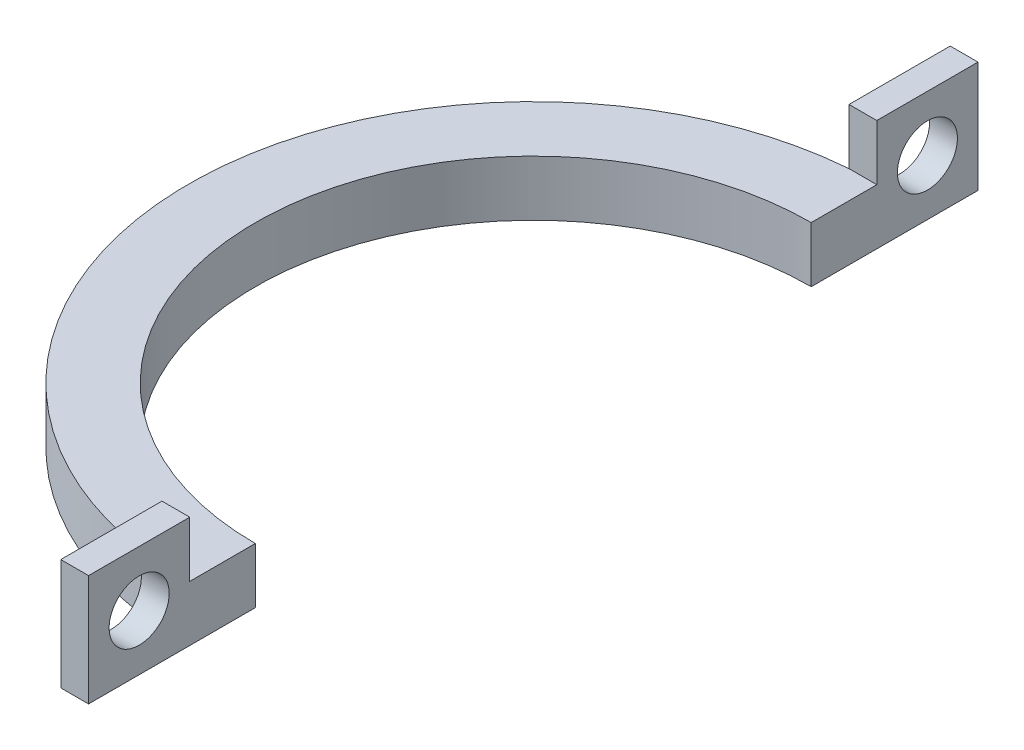
ISO-10303-21;
HEADER;
FILE_DESCRIPTION(('STEP AP214'),'2;1');
FILE_NAME('part.step','',(''),(''),'','','');
FILE_SCHEMA(('AUTOMOTIVE_DESIGN { 1 0 10303 214 1 1 1 1 }'));
ENDSEC;
DATA;
#1=APPLICATION_CONTEXT('core data for automotive mechanical design processes');
#2=APPLICATION_PROTOCOL_DEFINITION('international standard','automotive_design',2000,#1);
#3=PRODUCT_CONTEXT('',#1,'mechanical');
#4=PRODUCT('Part','Part','',(#3));
#5=PRODUCT_RELATED_PRODUCT_CATEGORY('part','',(#4));
#6=PRODUCT_DEFINITION_FORMATION('','',#4);
#7=PRODUCT_DEFINITION_CONTEXT('part definition',#1,'design');
#8=PRODUCT_DEFINITION('design','',#6,#7);
#9=PRODUCT_DEFINITION_SHAPE('','',#8);
#10=(LENGTH_UNIT() NAMED_UNIT(*) SI_UNIT(.MILLI.,.METRE.));
#11=(NAMED_UNIT(*) PLANE_ANGLE_UNIT() SI_UNIT($,.RADIAN.));
#12=(NAMED_UNIT(*) SI_UNIT($,.STERADIAN.) SOLID_ANGLE_UNIT());
#13=UNCERTAINTY_MEASURE_WITH_UNIT(LENGTH_MEASURE(1.E-05),#10,'distance_accuracy_value','');
#14=(GEOMETRIC_REPRESENTATION_CONTEXT(3) GLOBAL_UNCERTAINTY_ASSIGNED_CONTEXT((#13)) GLOBAL_UNIT_ASSIGNED_CONTEXT((#10,
#11,#12)) REPRESENTATION_CONTEXT('',''));
#15=CARTESIAN_POINT('',(0.,0.,0.));
#16=DIRECTION('',(0.,0.,1.));
#17=DIRECTION('',(1.,0.,0.));
#18=AXIS2_PLACEMENT_3D('',#15,#16,#17);
#19=CARTESIAN_POINT('',(0.,5.,0.));
#20=DIRECTION('',(0.,1.,0.));
#21=DIRECTION('',(0.,0.,1.));
#22=AXIS2_PLACEMENT_3D('',#19,#20,#21);
#23=PLANE('',#22);
#24=CARTESIAN_POINT('',(0.,5.,0.));
#25=DIRECTION('',(0.,1.,0.));
#26=DIRECTION('',(0.,0.,1.));
#27=AXIS2_PLACEMENT_3D('',#24,#25,#26);
#28=CIRCLE('',#27,31.);
#29=CARTESIAN_POINT('',(-2.5,5.,-30.8990291109608));
#30=VERTEX_POINT('',#29);
#31=CARTESIAN_POINT('',(-2.5,5.,30.8990291109608));
#32=VERTEX_POINT('',#31);
#33=EDGE_CURVE('E210',#30,#32,#28,.T.);
#34=ORIENTED_EDGE('',*,*,#33,.T.);
#35=DIRECTION('',(-1.,0.,0.));
#36=VECTOR('',#35,1.);
#37=CARTESIAN_POINT('',(0.,5.,30.8990291109608));
#38=LINE('',#37,#36);
#39=CARTESIAN_POINT('',(0.,5.,30.8990291109608));
#40=VERTEX_POINT('',#39);
#41=EDGE_CURVE('E157',#40,#32,#38,.T.);
#42=ORIENTED_EDGE('',*,*,#41,.F.);
#43=DIRECTION('',(0.,0.,1.));
#44=VECTOR('',#43,1.);
#45=CARTESIAN_POINT('',(0.,5.,0.));
#46=LINE('',#45,#44);
#47=CARTESIAN_POINT('',(0.,5.,25.));
#48=VERTEX_POINT('',#47);
#49=EDGE_CURVE('E214',#48,#40,#46,.T.);
#50=ORIENTED_EDGE('',*,*,#49,.F.);
#51=CARTESIAN_POINT('',(0.,5.,0.));
#52=DIRECTION('',(0.,1.,0.));
#53=DIRECTION('',(0.,0.,1.));
#54=AXIS2_PLACEMENT_3D('',#51,#52,#53);
#55=CIRCLE('',#54,25.);
#56=CARTESIAN_POINT('',(0.,5.,-25.));
#57=VERTEX_POINT('',#56);
#58=EDGE_CURVE('E203',#57,#48,#55,.T.);
#59=ORIENTED_EDGE('',*,*,#58,.F.);
#60=DIRECTION('',(0.,0.,-1.));
#61=VECTOR('',#60,1.);
#62=CARTESIAN_POINT('',(0.,5.,0.));
#63=LINE('',#62,#61);
#64=CARTESIAN_POINT('',(0.,5.,-30.8990291109608));
#65=VERTEX_POINT('',#64);
#66=EDGE_CURVE('E206',#57,#65,#63,.T.);
#67=ORIENTED_EDGE('',*,*,#66,.T.);
#68=DIRECTION('',(1.,0.,0.));
#69=VECTOR('',#68,1.);
#70=CARTESIAN_POINT('',(-2.5,5.,-30.8990291109608));
#71=LINE('',#70,#69);
#72=EDGE_CURVE('E175',#30,#65,#71,.T.);
#73=ORIENTED_EDGE('',*,*,#72,.F.);
#74=EDGE_LOOP('',(#34,#42,#50,#59,#67,#73));
#75=FACE_BOUND('',#74,.T.);
#76=ADVANCED_FACE('F41',(#75),#23,.T.);
#77=CARTESIAN_POINT('',(0.,5.,0.));
#78=DIRECTION('',(0.,-1.,0.));
#79=DIRECTION('',(0.,0.,-1.));
#80=AXIS2_PLACEMENT_3D('',#77,#78,#79);
#81=CYLINDRICAL_SURFACE('',#80,25.);
#82=CARTESIAN_POINT('',(0.,0.,0.));
#83=DIRECTION('',(0.,1.,0.));
#84=DIRECTION('',(0.,0.,1.));
#85=AXIS2_PLACEMENT_3D('',#82,#83,#84);
#86=CIRCLE('',#85,25.);
#87=CARTESIAN_POINT('',(0.,0.,-25.));
#88=VERTEX_POINT('',#87);
#89=CARTESIAN_POINT('',(0.,0.,25.));
#90=VERTEX_POINT('',#89);
#91=EDGE_CURVE('E202',#88,#90,#86,.T.);
#92=ORIENTED_EDGE('',*,*,#91,.F.);
#93=DIRECTION('',(0.,-1.,0.));
#94=VECTOR('',#93,1.);
#95=CARTESIAN_POINT('',(0.,5.,-25.));
#96=LINE('',#95,#94);
#97=EDGE_CURVE('E11',#57,#88,#96,.T.);
#98=ORIENTED_EDGE('',*,*,#97,.F.);
#99=ORIENTED_EDGE('',*,*,#58,.T.);
#100=DIRECTION('',(0.,-1.,0.));
#101=VECTOR('',#100,1.);
#102=CARTESIAN_POINT('',(0.,5.,25.));
#103=LINE('',#102,#101);
#104=EDGE_CURVE('E66',#48,#90,#103,.T.);
#105=ORIENTED_EDGE('',*,*,#104,.T.);
#106=EDGE_LOOP('',(#92,#98,#99,#105));
#107=FACE_BOUND('',#106,.T.);
#108=ADVANCED_FACE('F43',(#107),#81,.F.);
#109=CARTESIAN_POINT('',(0.,5.,0.));
#110=DIRECTION('',(-1.,0.,0.));
#111=DIRECTION('',(0.,0.,1.));
#112=AXIS2_PLACEMENT_3D('',#109,#110,#111);
#113=PLANE('',#112);
#114=CARTESIAN_POINT('',(0.,5.,-35.4495145554804));
#115=DIRECTION('',(-1.,0.,0.));
#116=DIRECTION('',(0.,0.,1.));
#117=AXIS2_PLACEMENT_3D('',#114,#115,#116);
#118=CIRCLE('',#117,2.7);
#119=CARTESIAN_POINT('',(0.,5.,-32.7495145554804));
#120=VERTEX_POINT('',#119);
#121=EDGE_CURVE('E160',#120,#120,#118,.F.);
#122=ORIENTED_EDGE('',*,*,#121,.F.);
#123=EDGE_LOOP('',(#122));
#124=FACE_BOUND('',#123,.T.);
#125=DIRECTION('',(0.,0.,-1.));
#126=VECTOR('',#125,1.);
#127=CARTESIAN_POINT('',(0.,0.,0.));
#128=LINE('',#127,#126);
#129=CARTESIAN_POINT('',(0.,0.,-40.));
#130=VERTEX_POINT('',#129);
#131=EDGE_CURVE('E219',#88,#130,#128,.T.);
#132=ORIENTED_EDGE('',*,*,#131,.T.);
#133=DIRECTION('',(0.,-1.,0.));
#134=VECTOR('',#133,1.);
#135=CARTESIAN_POINT('',(0.,5.,-40.));
#136=LINE('',#135,#134);
#137=CARTESIAN_POINT('',(0.,10.,-40.));
#138=VERTEX_POINT('',#137);
#139=EDGE_CURVE('E50',#138,#130,#136,.T.);
#140=ORIENTED_EDGE('',*,*,#139,.F.);
#141=DIRECTION('',(0.,0.,-1.));
#142=VECTOR('',#141,1.);
#143=CARTESIAN_POINT('',(0.,10.,-30.8990291109608));
#144=LINE('',#143,#142);
#145=CARTESIAN_POINT('',(0.,10.,-30.8990291109608));
#146=VERTEX_POINT('',#145);
#147=EDGE_CURVE('E183',#146,#138,#144,.T.);
#148=ORIENTED_EDGE('',*,*,#147,.F.);
#149=DIRECTION('',(0.,-1.,0.));
#150=VECTOR('',#149,1.);
#151=CARTESIAN_POINT('',(0.,10.,-30.8990291109608));
#152=LINE('',#151,#150);
#153=EDGE_CURVE('E191',#146,#65,#152,.T.);
#154=ORIENTED_EDGE('',*,*,#153,.T.);
#155=ORIENTED_EDGE('',*,*,#66,.F.);
#156=ORIENTED_EDGE('',*,*,#97,.T.);
#157=EDGE_LOOP('',(#132,#140,#148,#154,#155,#156));
#158=FACE_BOUND('',#157,.T.);
#159=ADVANCED_FACE('F281',(#124,#158),#113,.F.);
#160=CARTESIAN_POINT('',(0.,5.,-40.));
#161=DIRECTION('',(0.,0.,1.));
#162=DIRECTION('',(1.,0.,0.));
#163=AXIS2_PLACEMENT_3D('',#160,#161,#162);
#164=PLANE('',#163);
#165=DIRECTION('',(-1.,0.,0.));
#166=VECTOR('',#165,1.);
#167=CARTESIAN_POINT('',(0.,0.,-40.));
#168=LINE('',#167,#166);
#169=CARTESIAN_POINT('',(-2.5,0.,-40.));
#170=VERTEX_POINT('',#169);
#171=EDGE_CURVE('E222',#130,#170,#168,.T.);
#172=ORIENTED_EDGE('',*,*,#171,.T.);
#173=DIRECTION('',(0.,-1.,0.));
#174=VECTOR('',#173,1.);
#175=CARTESIAN_POINT('',(-2.5,5.,-40.));
#176=LINE('',#175,#174);
#177=CARTESIAN_POINT('',(-2.5,10.,-40.));
#178=VERTEX_POINT('',#177);
#179=EDGE_CURVE('E250',#178,#170,#176,.T.);
#180=ORIENTED_EDGE('',*,*,#179,.F.);
#181=DIRECTION('',(-1.,0.,0.));
#182=VECTOR('',#181,1.);
#183=CARTESIAN_POINT('',(0.,10.,-40.));
#184=LINE('',#183,#182);
#185=EDGE_CURVE('E187',#138,#178,#184,.T.);
#186=ORIENTED_EDGE('',*,*,#185,.F.);
#187=ORIENTED_EDGE('',*,*,#139,.T.);
#188=EDGE_LOOP('',(#172,#180,#186,#187));
#189=FACE_BOUND('',#188,.T.);
#190=ADVANCED_FACE('F258',(#189),#164,.F.);
#191=CARTESIAN_POINT('',(-2.5,5.,0.));
#192=DIRECTION('',(1.,0.,0.));
#193=DIRECTION('',(0.,0.,-1.));
#194=AXIS2_PLACEMENT_3D('',#191,#192,#193);
#195=PLANE('',#194);
#196=CARTESIAN_POINT('',(-2.5,5.,-35.4495145554804));
#197=DIRECTION('',(-1.,0.,0.));
#198=DIRECTION('',(0.,0.,1.));
#199=AXIS2_PLACEMENT_3D('',#196,#197,#198);
#200=CIRCLE('',#199,2.7);
#201=CARTESIAN_POINT('',(-2.5,5.,-32.7495145554804));
#202=VERTEX_POINT('',#201);
#203=EDGE_CURVE('E465',#202,#202,#200,.T.);
#204=ORIENTED_EDGE('',*,*,#203,.F.);
#205=EDGE_LOOP('',(#204));
#206=FACE_BOUND('',#205,.T.);
#207=DIRECTION('',(0.,0.,1.));
#208=VECTOR('',#207,1.);
#209=CARTESIAN_POINT('',(-2.5,0.,0.));
#210=LINE('',#209,#208);
#211=CARTESIAN_POINT('',(-2.5,0.,-30.8990291109608));
#212=VERTEX_POINT('',#211);
#213=EDGE_CURVE('E225',#170,#212,#210,.T.);
#214=ORIENTED_EDGE('',*,*,#213,.T.);
#215=DIRECTION('',(0.,-1.,0.));
#216=VECTOR('',#215,1.);
#217=CARTESIAN_POINT('',(-2.5,5.,-30.8990291109608));
#218=LINE('',#217,#216);
#219=EDGE_CURVE('E246',#30,#212,#218,.T.);
#220=ORIENTED_EDGE('',*,*,#219,.F.);
#221=DIRECTION('',(0.,-1.,0.));
#222=VECTOR('',#221,1.);
#223=CARTESIAN_POINT('',(-2.5,10.,-30.8990291109608));
#224=LINE('',#223,#222);
#225=CARTESIAN_POINT('',(-2.5,10.,-30.8990291109608));
#226=VERTEX_POINT('',#225);
#227=EDGE_CURVE('E198',#226,#30,#224,.T.);
#228=ORIENTED_EDGE('',*,*,#227,.F.);
#229=DIRECTION('',(0.,0.,1.));
#230=VECTOR('',#229,1.);
#231=CARTESIAN_POINT('',(-2.5,10.,-40.));
#232=LINE('',#231,#230);
#233=EDGE_CURVE('E176',#178,#226,#232,.T.);
#234=ORIENTED_EDGE('',*,*,#233,.F.);
#235=ORIENTED_EDGE('',*,*,#179,.T.);
#236=EDGE_LOOP('',(#214,#220,#228,#234,#235));
#237=FACE_BOUND('',#236,.T.);
#238=ADVANCED_FACE('F268',(#206,#237),#195,.F.);
#239=CARTESIAN_POINT('',(0.,5.,0.));
#240=DIRECTION('',(0.,-1.,0.));
#241=DIRECTION('',(0.,0.,-1.));
#242=AXIS2_PLACEMENT_3D('',#239,#240,#241);
#243=CYLINDRICAL_SURFACE('',#242,31.);
#244=CARTESIAN_POINT('',(0.,0.,0.));
#245=DIRECTION('',(0.,1.,0.));
#246=DIRECTION('',(0.,0.,1.));
#247=AXIS2_PLACEMENT_3D('',#244,#245,#246);
#248=CIRCLE('',#247,31.);
#249=CARTESIAN_POINT('',(-2.5,0.,30.8990291109608));
#250=VERTEX_POINT('',#249);
#251=EDGE_CURVE('E228',#212,#250,#248,.T.);
#252=ORIENTED_EDGE('',*,*,#251,.T.);
#253=DIRECTION('',(0.,-1.,0.));
#254=VECTOR('',#253,1.);
#255=CARTESIAN_POINT('',(-2.5,5.,30.8990291109608));
#256=LINE('',#255,#254);
#257=EDGE_CURVE('E142',#32,#250,#256,.T.);
#258=ORIENTED_EDGE('',*,*,#257,.F.);
#259=ORIENTED_EDGE('',*,*,#33,.F.);
#260=ORIENTED_EDGE('',*,*,#219,.T.);
#261=EDGE_LOOP('',(#252,#258,#259,#260));
#262=FACE_BOUND('',#261,.T.);
#263=ADVANCED_FACE('F273',(#262),#243,.T.);
#264=CARTESIAN_POINT('',(-2.5,5.,0.));
#265=DIRECTION('',(-1.,0.,0.));
#266=DIRECTION('',(0.,0.,1.));
#267=AXIS2_PLACEMENT_3D('',#264,#265,#266);
#268=PLANE('',#267);
#269=CARTESIAN_POINT('',(-2.5,5.,35.4495145554804));
#270=DIRECTION('',(-1.,0.,0.));
#271=DIRECTION('',(0.,0.,-1.));
#272=AXIS2_PLACEMENT_3D('',#269,#270,#271);
#273=CIRCLE('',#272,2.7);
#274=CARTESIAN_POINT('',(-2.5,5.,32.7495145554804));
#275=VERTEX_POINT('',#274);
#276=EDGE_CURVE('E471',#275,#275,#273,.T.);
#277=ORIENTED_EDGE('',*,*,#276,.F.);
#278=EDGE_LOOP('',(#277));
#279=FACE_BOUND('',#278,.T.);
#280=DIRECTION('',(0.,0.,-1.));
#281=VECTOR('',#280,1.);
#282=CARTESIAN_POINT('',(-2.5,0.,0.));
#283=LINE('',#282,#281);
#284=CARTESIAN_POINT('',(-2.5,0.,40.));
#285=VERTEX_POINT('',#284);
#286=EDGE_CURVE('E137',#285,#250,#283,.T.);
#287=ORIENTED_EDGE('',*,*,#286,.F.);
#288=DIRECTION('',(0.,-1.,0.));
#289=VECTOR('',#288,1.);
#290=CARTESIAN_POINT('',(-2.5,5.,40.));
#291=LINE('',#290,#289);
#292=CARTESIAN_POINT('',(-2.5,10.,40.));
#293=VERTEX_POINT('',#292);
#294=EDGE_CURVE('E130',#293,#285,#291,.T.);
#295=ORIENTED_EDGE('',*,*,#294,.F.);
#296=DIRECTION('',(0.,0.,1.));
#297=VECTOR('',#296,1.);
#298=CARTESIAN_POINT('',(-2.5,10.,30.8990291109608));
#299=LINE('',#298,#297);
#300=CARTESIAN_POINT('',(-2.5,10.,30.8990291109608));
#301=VERTEX_POINT('',#300);
#302=EDGE_CURVE('E135',#301,#293,#299,.T.);
#303=ORIENTED_EDGE('',*,*,#302,.F.);
#304=DIRECTION('',(0.,-1.,0.));
#305=VECTOR('',#304,1.);
#306=CARTESIAN_POINT('',(-2.5,10.,30.8990291109608));
#307=LINE('',#306,#305);
#308=EDGE_CURVE('E169',#301,#32,#307,.T.);
#309=ORIENTED_EDGE('',*,*,#308,.T.);
#310=ORIENTED_EDGE('',*,*,#257,.T.);
#311=EDGE_LOOP('',(#287,#295,#303,#309,#310));
#312=FACE_BOUND('',#311,.T.);
#313=ADVANCED_FACE('F132',(#279,#312),#268,.T.);
#314=CARTESIAN_POINT('',(0.,5.,40.));
#315=DIRECTION('',(0.,0.,1.));
#316=DIRECTION('',(1.,0.,0.));
#317=AXIS2_PLACEMENT_3D('',#314,#315,#316);
#318=PLANE('',#317);
#319=DIRECTION('',(-1.,0.,0.));
#320=VECTOR('',#319,1.);
#321=CARTESIAN_POINT('',(0.,0.,40.));
#322=LINE('',#321,#320);
#323=CARTESIAN_POINT('',(0.,0.,40.));
#324=VERTEX_POINT('',#323);
#325=EDGE_CURVE('E234',#324,#285,#322,.T.);
#326=ORIENTED_EDGE('',*,*,#325,.F.);
#327=DIRECTION('',(0.,-1.,0.));
#328=VECTOR('',#327,1.);
#329=CARTESIAN_POINT('',(0.,5.,40.));
#330=LINE('',#329,#328);
#331=CARTESIAN_POINT('',(0.,10.,40.));
#332=VERTEX_POINT('',#331);
#333=EDGE_CURVE('E143',#332,#324,#330,.T.);
#334=ORIENTED_EDGE('',*,*,#333,.F.);
#335=DIRECTION('',(1.,0.,0.));
#336=VECTOR('',#335,1.);
#337=CARTESIAN_POINT('',(-2.5,10.,40.));
#338=LINE('',#337,#336);
#339=EDGE_CURVE('E146',#293,#332,#338,.T.);
#340=ORIENTED_EDGE('',*,*,#339,.F.);
#341=ORIENTED_EDGE('',*,*,#294,.T.);
#342=EDGE_LOOP('',(#326,#334,#340,#341));
#343=FACE_BOUND('',#342,.T.);
#344=ADVANCED_FACE('F147',(#343),#318,.T.);
#345=CARTESIAN_POINT('',(0.,5.,0.));
#346=DIRECTION('',(1.,0.,0.));
#347=DIRECTION('',(0.,0.,-1.));
#348=AXIS2_PLACEMENT_3D('',#345,#346,#347);
#349=PLANE('',#348);
#350=CARTESIAN_POINT('',(0.,5.,35.4495145554804));
#351=DIRECTION('',(1.,0.,0.));
#352=DIRECTION('',(0.,0.,-1.));
#353=AXIS2_PLACEMENT_3D('',#350,#351,#352);
#354=CIRCLE('',#353,2.7);
#355=CARTESIAN_POINT('',(0.,5.,32.7495145554804));
#356=VERTEX_POINT('',#355);
#357=EDGE_CURVE('E163',#356,#356,#354,.F.);
#358=ORIENTED_EDGE('',*,*,#357,.T.);
#359=EDGE_LOOP('',(#358));
#360=FACE_BOUND('',#359,.T.);
#361=DIRECTION('',(0.,0.,1.));
#362=VECTOR('',#361,1.);
#363=CARTESIAN_POINT('',(0.,0.,0.));
#364=LINE('',#363,#362);
#365=EDGE_CURVE('E207',#90,#324,#364,.T.);
#366=ORIENTED_EDGE('',*,*,#365,.F.);
#367=ORIENTED_EDGE('',*,*,#104,.F.);
#368=ORIENTED_EDGE('',*,*,#49,.T.);
#369=DIRECTION('',(0.,-1.,0.));
#370=VECTOR('',#369,1.);
#371=CARTESIAN_POINT('',(0.,10.,30.8990291109608));
#372=LINE('',#371,#370);
#373=CARTESIAN_POINT('',(0.,10.,30.8990291109608));
#374=VERTEX_POINT('',#373);
#375=EDGE_CURVE('E57',#374,#40,#372,.T.);
#376=ORIENTED_EDGE('',*,*,#375,.F.);
#377=DIRECTION('',(0.,0.,-1.));
#378=VECTOR('',#377,1.);
#379=CARTESIAN_POINT('',(0.,10.,40.));
#380=LINE('',#379,#378);
#381=EDGE_CURVE('E151',#332,#374,#380,.T.);
#382=ORIENTED_EDGE('',*,*,#381,.F.);
#383=ORIENTED_EDGE('',*,*,#333,.T.);
#384=EDGE_LOOP('',(#366,#367,#368,#376,#382,#383));
#385=FACE_BOUND('',#384,.T.);
#386=ADVANCED_FACE('F298',(#360,#385),#349,.T.);
#387=CARTESIAN_POINT('',(0.,0.,0.));
#388=DIRECTION('',(0.,1.,0.));
#389=DIRECTION('',(0.,0.,1.));
#390=AXIS2_PLACEMENT_3D('',#387,#388,#389);
#391=PLANE('',#390);
#392=ORIENTED_EDGE('',*,*,#91,.T.);
#393=ORIENTED_EDGE('',*,*,#365,.T.);
#394=ORIENTED_EDGE('',*,*,#325,.T.);
#395=ORIENTED_EDGE('',*,*,#286,.T.);
#396=ORIENTED_EDGE('',*,*,#251,.F.);
#397=ORIENTED_EDGE('',*,*,#213,.F.);
#398=ORIENTED_EDGE('',*,*,#171,.F.);
#399=ORIENTED_EDGE('',*,*,#131,.F.);
#400=EDGE_LOOP('',(#392,#393,#394,#395,#396,#397,#398,#399));
#401=FACE_BOUND('',#400,.T.);
#402=ADVANCED_FACE('F264',(#401),#391,.F.);
#403=CARTESIAN_POINT('',(-2.5,10.,-30.8990291109608));
#404=DIRECTION('',(0.,0.,-1.));
#405=DIRECTION('',(-1.,0.,0.));
#406=AXIS2_PLACEMENT_3D('',#403,#404,#405);
#407=PLANE('',#406);
#408=ORIENTED_EDGE('',*,*,#72,.T.);
#409=ORIENTED_EDGE('',*,*,#153,.F.);
#410=DIRECTION('',(1.,0.,0.));
#411=VECTOR('',#410,1.);
#412=CARTESIAN_POINT('',(-2.5,10.,-30.8990291109608));
#413=LINE('',#412,#411);
#414=EDGE_CURVE('E180',#226,#146,#413,.T.);
#415=ORIENTED_EDGE('',*,*,#414,.F.);
#416=ORIENTED_EDGE('',*,*,#227,.T.);
#417=EDGE_LOOP('',(#408,#409,#415,#416));
#418=FACE_BOUND('',#417,.T.);
#419=ADVANCED_FACE('F277',(#418),#407,.F.);
#420=CARTESIAN_POINT('',(0.,10.,0.));
#421=DIRECTION('',(0.,1.,0.));
#422=DIRECTION('',(0.,0.,1.));
#423=AXIS2_PLACEMENT_3D('',#420,#421,#422);
#424=PLANE('',#423);
#425=ORIENTED_EDGE('',*,*,#233,.T.);
#426=ORIENTED_EDGE('',*,*,#414,.T.);
#427=ORIENTED_EDGE('',*,*,#147,.T.);
#428=ORIENTED_EDGE('',*,*,#185,.T.);
#429=EDGE_LOOP('',(#425,#426,#427,#428));
#430=FACE_BOUND('',#429,.T.);
#431=ADVANCED_FACE('F280',(#430),#424,.T.);
#432=CARTESIAN_POINT('',(0.,10.,30.8990291109608));
#433=DIRECTION('',(0.,0.,1.));
#434=DIRECTION('',(1.,0.,0.));
#435=AXIS2_PLACEMENT_3D('',#432,#433,#434);
#436=PLANE('',#435);
#437=ORIENTED_EDGE('',*,*,#41,.T.);
#438=ORIENTED_EDGE('',*,*,#308,.F.);
#439=DIRECTION('',(-1.,0.,0.));
#440=VECTOR('',#439,1.);
#441=CARTESIAN_POINT('',(0.,10.,30.8990291109608));
#442=LINE('',#441,#440);
#443=EDGE_CURVE('E154',#374,#301,#442,.T.);
#444=ORIENTED_EDGE('',*,*,#443,.F.);
#445=ORIENTED_EDGE('',*,*,#375,.T.);
#446=EDGE_LOOP('',(#437,#438,#444,#445));
#447=FACE_BOUND('',#446,.T.);
#448=ADVANCED_FACE('F353',(#447),#436,.F.);
#449=CARTESIAN_POINT('',(0.,10.,0.));
#450=DIRECTION('',(0.,1.,0.));
#451=DIRECTION('',(0.,0.,1.));
#452=AXIS2_PLACEMENT_3D('',#449,#450,#451);
#453=PLANE('',#452);
#454=ORIENTED_EDGE('',*,*,#302,.T.);
#455=ORIENTED_EDGE('',*,*,#339,.T.);
#456=ORIENTED_EDGE('',*,*,#381,.T.);
#457=ORIENTED_EDGE('',*,*,#443,.T.);
#458=EDGE_LOOP('',(#454,#455,#456,#457));
#459=FACE_BOUND('',#458,.T.);
#460=ADVANCED_FACE('F153',(#459),#453,.T.);
#461=CARTESIAN_POINT('',(0.00100000000000013,5.,35.4495145554804));
#462=DIRECTION('',(-1.,0.,0.));
#463=DIRECTION('',(0.,0.,1.));
#464=AXIS2_PLACEMENT_3D('',#461,#462,#463);
#465=CYLINDRICAL_SURFACE('',#464,2.7);
#466=ORIENTED_EDGE('',*,*,#357,.F.);
#467=EDGE_LOOP('',(#466));
#468=FACE_BOUND('',#467,.T.);
#469=ORIENTED_EDGE('',*,*,#276,.T.);
#470=EDGE_LOOP('',(#469));
#471=FACE_BOUND('',#470,.T.);
#472=ADVANCED_FACE('F365',(#468,#471),#465,.F.);
#473=CARTESIAN_POINT('',(0.00100000000000013,5.,-35.4495145554804));
#474=DIRECTION('',(-1.,0.,0.));
#475=DIRECTION('',(0.,0.,1.));
#476=AXIS2_PLACEMENT_3D('',#473,#474,#475);
#477=CYLINDRICAL_SURFACE('',#476,2.7);
#478=ORIENTED_EDGE('',*,*,#203,.T.);
#479=EDGE_LOOP('',(#478));
#480=FACE_BOUND('',#479,.T.);
#481=ORIENTED_EDGE('',*,*,#121,.T.);
#482=EDGE_LOOP('',(#481));
#483=FACE_BOUND('',#482,.T.);
#484=ADVANCED_FACE('F371',(#480,#483),#477,.F.);
#485=CLOSED_SHELL('',(#76,#108,#159,#190,#238,#263,#313,#344,#386,#402,#419,#431,#448,#460,#472,#484));
#486=MANIFOLD_SOLID_BREP('B2',#485);
#487=ADVANCED_BREP_SHAPE_REPRESENTATION('',(#18,#486),#14);
#488=SHAPE_DEFINITION_REPRESENTATION(#9,#487);
ENDSEC;
END-ISO-10303-21;
